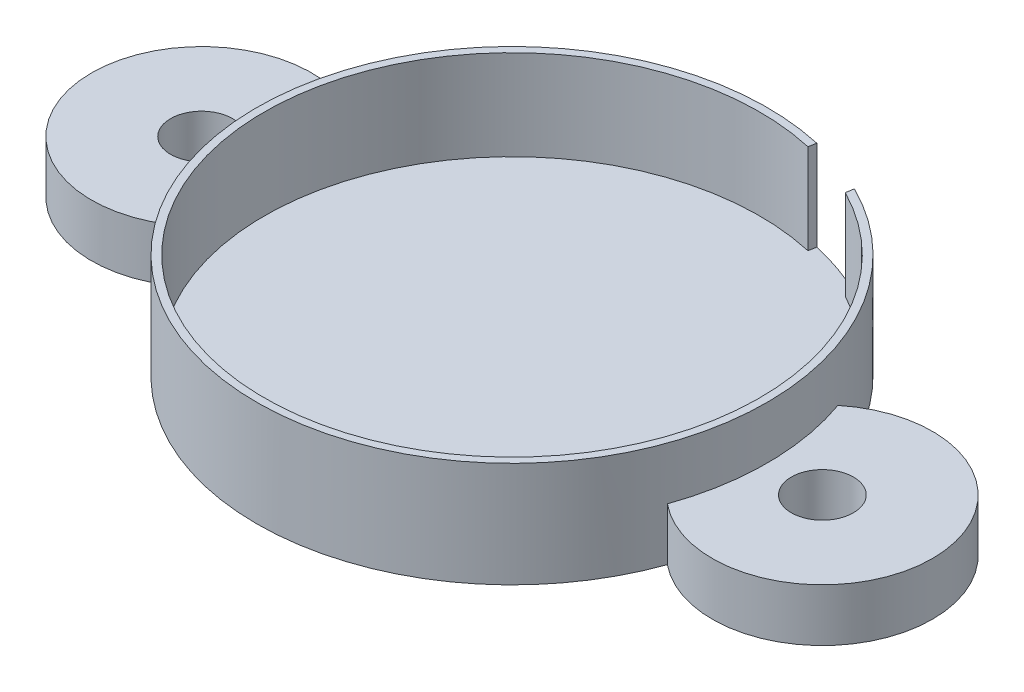
ISO-10303-21;
HEADER;
FILE_DESCRIPTION(('STEP AP214'),'2;1');
FILE_NAME('part.step','',(''),(''),'','','');
FILE_SCHEMA(('AUTOMOTIVE_DESIGN { 1 0 10303 214 1 1 1 1 }'));
ENDSEC;
DATA;
#1=APPLICATION_CONTEXT('core data for automotive mechanical design processes');
#2=APPLICATION_PROTOCOL_DEFINITION('international standard','automotive_design',2000,#1);
#3=PRODUCT_CONTEXT('',#1,'mechanical');
#4=PRODUCT('Part','Part','',(#3));
#5=PRODUCT_RELATED_PRODUCT_CATEGORY('part','',(#4));
#6=PRODUCT_DEFINITION_FORMATION('','',#4);
#7=PRODUCT_DEFINITION_CONTEXT('part definition',#1,'design');
#8=PRODUCT_DEFINITION('design','',#6,#7);
#9=PRODUCT_DEFINITION_SHAPE('','',#8);
#10=(LENGTH_UNIT() NAMED_UNIT(*) SI_UNIT(.MILLI.,.METRE.));
#11=(NAMED_UNIT(*) PLANE_ANGLE_UNIT() SI_UNIT($,.RADIAN.));
#12=(NAMED_UNIT(*) SI_UNIT($,.STERADIAN.) SOLID_ANGLE_UNIT());
#13=UNCERTAINTY_MEASURE_WITH_UNIT(LENGTH_MEASURE(1.E-05),#10,'distance_accuracy_value','');
#14=(GEOMETRIC_REPRESENTATION_CONTEXT(3) GLOBAL_UNCERTAINTY_ASSIGNED_CONTEXT((#13)) GLOBAL_UNIT_ASSIGNED_CONTEXT((#10,
#11,#12)) REPRESENTATION_CONTEXT('',''));
#15=CARTESIAN_POINT('',(0.,0.,0.));
#16=DIRECTION('',(0.,0.,1.));
#17=DIRECTION('',(1.,0.,0.));
#18=AXIS2_PLACEMENT_3D('',#15,#16,#17);
#19=CARTESIAN_POINT('',(0.,21.971,0.));
#20=DIRECTION('',(0.,-1.,0.));
#21=DIRECTION('',(0.,0.,-1.));
#22=AXIS2_PLACEMENT_3D('',#19,#20,#21);
#23=CYLINDRICAL_SURFACE('',#22,53.2765);
#24=CARTESIAN_POINT('',(0.,0.,0.));
#25=DIRECTION('',(0.,1.,0.));
#26=DIRECTION('',(0.,0.,1.));
#27=AXIS2_PLACEMENT_3D('',#24,#25,#26);
#28=CIRCLE('',#27,53.2765);
#29=CARTESIAN_POINT('',(50.2172007352941,0.,-17.7937686441399));
#30=VERTEX_POINT('',#29);
#31=CARTESIAN_POINT('',(-50.2172007352941,0.,-17.7937686441399));
#32=VERTEX_POINT('',#31);
#33=EDGE_CURVE('E39',#30,#32,#28,.T.);
#34=ORIENTED_EDGE('',*,*,#33,.T.);
#35=DIRECTION('',(0.,-1.,0.));
#36=VECTOR('',#35,1.);
#37=CARTESIAN_POINT('',(-50.2172007352941,10.9855,-17.7937686441399));
#38=LINE('',#37,#36);
#39=CARTESIAN_POINT('',(-50.2172007352941,10.9855,-17.7937686441399));
#40=VERTEX_POINT('',#39);
#41=EDGE_CURVE('E55',#40,#32,#38,.T.);
#42=ORIENTED_EDGE('',*,*,#41,.F.);
#43=CARTESIAN_POINT('',(1.04777297948999E-12,10.9855,0.));
#44=DIRECTION('',(0.,1.,0.));
#45=DIRECTION('',(0.,0.,1.));
#46=AXIS2_PLACEMENT_3D('',#43,#44,#45);
#47=CIRCLE('',#46,53.276500000001);
#48=CARTESIAN_POINT('',(-50.2172007352941,10.9855,17.7937686441399));
#49=VERTEX_POINT('',#48);
#50=EDGE_CURVE('E50',#40,#49,#47,.T.);
#51=ORIENTED_EDGE('',*,*,#50,.T.);
#52=DIRECTION('',(0.,-1.,0.));
#53=VECTOR('',#52,1.);
#54=CARTESIAN_POINT('',(-50.2172007352941,10.9855,17.7937686441399));
#55=LINE('',#54,#53);
#56=CARTESIAN_POINT('',(-50.2172007352941,0.,17.7937686441399));
#57=VERTEX_POINT('',#56);
#58=EDGE_CURVE('E108',#49,#57,#55,.T.);
#59=ORIENTED_EDGE('',*,*,#58,.T.);
#60=CARTESIAN_POINT('',(50.2172007352941,0.,17.7937686441399));
#61=VERTEX_POINT('',#60);
#62=EDGE_CURVE('E99',#57,#61,#28,.T.);
#63=ORIENTED_EDGE('',*,*,#62,.T.);
#64=DIRECTION('',(0.,-1.,0.));
#65=VECTOR('',#64,1.);
#66=CARTESIAN_POINT('',(50.2172007352941,10.9855,17.7937686441399));
#67=LINE('',#66,#65);
#68=CARTESIAN_POINT('',(50.2172007352941,10.9855,17.7937686441399));
#69=VERTEX_POINT('',#68);
#70=EDGE_CURVE('E138',#69,#61,#67,.T.);
#71=ORIENTED_EDGE('',*,*,#70,.F.);
#72=CARTESIAN_POINT('',(0.,10.9855,0.));
#73=DIRECTION('',(0.,1.,0.));
#74=DIRECTION('',(0.,0.,1.));
#75=AXIS2_PLACEMENT_3D('',#72,#73,#74);
#76=CIRCLE('',#75,53.2765);
#77=CARTESIAN_POINT('',(50.2172007352941,10.9855,-17.7937686441399));
#78=VERTEX_POINT('',#77);
#79=EDGE_CURVE('E131',#69,#78,#76,.T.);
#80=ORIENTED_EDGE('',*,*,#79,.T.);
#81=DIRECTION('',(0.,-1.,0.));
#82=VECTOR('',#81,1.);
#83=CARTESIAN_POINT('',(50.2172007352941,10.9855,-17.7937686441399));
#84=LINE('',#83,#82);
#85=EDGE_CURVE('E136',#78,#30,#84,.T.);
#86=ORIENTED_EDGE('',*,*,#85,.T.);
#87=EDGE_LOOP('',(#34,#42,#51,#59,#63,#71,#80,#86));
#88=FACE_BOUND('',#87,.T.);
#89=CARTESIAN_POINT('',(0.,3.175,0.));
#90=DIRECTION('',(0.,1.,0.));
#91=DIRECTION('',(0.,0.,1.));
#92=AXIS2_PLACEMENT_3D('',#89,#90,#91);
#93=CIRCLE('',#92,53.2765);
#94=CARTESIAN_POINT('',(23.788647288691,3.175,-47.670595889125));
#95=VERTEX_POINT('',#94);
#96=CARTESIAN_POINT('',(11.6118386253483,3.175,-51.9956792049962));
#97=VERTEX_POINT('',#96);
#98=EDGE_CURVE('E143',#95,#97,#93,.T.);
#99=ORIENTED_EDGE('',*,*,#98,.F.);
#100=DIRECTION('',(0.,1.,0.));
#101=VECTOR('',#100,1.);
#102=CARTESIAN_POINT('',(23.788647288691,3.175,-47.670595889125));
#103=LINE('',#102,#101);
#104=CARTESIAN_POINT('',(23.788647288691,21.971,-47.670595889125));
#105=VERTEX_POINT('',#104);
#106=EDGE_CURVE('E155',#95,#105,#103,.T.);
#107=ORIENTED_EDGE('',*,*,#106,.T.);
#108=CARTESIAN_POINT('',(0.,21.971,0.));
#109=DIRECTION('',(0.,1.,0.));
#110=DIRECTION('',(0.,0.,1.));
#111=AXIS2_PLACEMENT_3D('',#108,#109,#110);
#112=CIRCLE('',#111,53.2765);
#113=CARTESIAN_POINT('',(11.6118386253483,21.971,-51.9956792049962));
#114=VERTEX_POINT('',#113);
#115=EDGE_CURVE('E11',#114,#105,#112,.T.);
#116=ORIENTED_EDGE('',*,*,#115,.F.);
#117=DIRECTION('',(0.,1.,0.));
#118=VECTOR('',#117,1.);
#119=CARTESIAN_POINT('',(11.6118386253483,3.175,-51.9956792049962));
#120=LINE('',#119,#118);
#121=EDGE_CURVE('E152',#97,#114,#120,.T.);
#122=ORIENTED_EDGE('',*,*,#121,.F.);
#123=EDGE_LOOP('',(#99,#107,#116,#122));
#124=FACE_BOUND('',#123,.T.);
#125=ADVANCED_FACE('F36',(#88,#124),#23,.T.);
#126=CARTESIAN_POINT('',(0.,21.971,0.));
#127=DIRECTION('',(0.,1.,0.));
#128=DIRECTION('',(0.,0.,1.));
#129=AXIS2_PLACEMENT_3D('',#126,#127,#128);
#130=PLANE('',#129);
#131=DIRECTION('',(0.163513107643357,0.,-0.986541161649534));
#132=VECTOR('',#131,1.);
#133=CARTESIAN_POINT('',(23.5166544436369,21.971,-46.0295522982634));
#134=LINE('',#133,#132);
#135=CARTESIAN_POINT('',(23.5166544436369,21.971,-46.0295522982634));
#136=VERTEX_POINT('',#135);
#137=EDGE_CURVE('E147',#136,#105,#134,.T.);
#138=ORIENTED_EDGE('',*,*,#137,.F.);
#139=CARTESIAN_POINT('',(0.,21.971,0.));
#140=DIRECTION('',(0.,1.,0.));
#141=DIRECTION('',(0.,0.,1.));
#142=AXIS2_PLACEMENT_3D('',#139,#140,#141);
#143=CIRCLE('',#142,51.689);
#144=CARTESIAN_POINT('',(11.3334056157357,21.971,-50.4312069868371));
#145=VERTEX_POINT('',#144);
#146=EDGE_CURVE('E158',#145,#136,#143,.T.);
#147=ORIENTED_EDGE('',*,*,#146,.F.);
#148=DIRECTION('',(-0.175219154451826,0.,0.984529455076478));
#149=VECTOR('',#148,1.);
#150=CARTESIAN_POINT('',(11.3334056157357,21.971,-50.4312069868371));
#151=LINE('',#150,#149);
#152=EDGE_CURVE('E140',#114,#145,#151,.T.);
#153=ORIENTED_EDGE('',*,*,#152,.F.);
#154=ORIENTED_EDGE('',*,*,#115,.T.);
#155=EDGE_LOOP('',(#138,#147,#153,#154));
#156=FACE_BOUND('',#155,.T.);
#157=ADVANCED_FACE('F177',(#156),#130,.T.);
#158=CARTESIAN_POINT('',(0.,0.,0.));
#159=DIRECTION('',(0.,1.,0.));
#160=DIRECTION('',(0.,0.,1.));
#161=AXIS2_PLACEMENT_3D('',#158,#159,#160);
#162=PLANE('',#161);
#163=ORIENTED_EDGE('',*,*,#33,.F.);
#164=CARTESIAN_POINT('',(64.77,0.,0.));
#165=DIRECTION('',(0.,-1.,0.));
#166=DIRECTION('',(0.,0.,-1.));
#167=AXIS2_PLACEMENT_3D('',#164,#165,#166);
#168=CIRCLE('',#167,22.987);
#169=EDGE_CURVE('E105',#30,#61,#168,.T.);
#170=ORIENTED_EDGE('',*,*,#169,.T.);
#171=ORIENTED_EDGE('',*,*,#62,.F.);
#172=CARTESIAN_POINT('',(-64.77,0.,0.));
#173=DIRECTION('',(0.,-1.,0.));
#174=DIRECTION('',(0.,0.,-1.));
#175=AXIS2_PLACEMENT_3D('',#172,#173,#174);
#176=CIRCLE('',#175,22.987);
#177=EDGE_CURVE('E103',#57,#32,#176,.T.);
#178=ORIENTED_EDGE('',*,*,#177,.T.);
#179=EDGE_LOOP('',(#163,#170,#171,#178));
#180=FACE_BOUND('',#179,.T.);
#181=CARTESIAN_POINT('',(64.77,0.,0.));
#182=DIRECTION('',(0.,-1.,0.));
#183=DIRECTION('',(0.,0.,-1.));
#184=AXIS2_PLACEMENT_3D('',#181,#182,#183);
#185=CIRCLE('',#184,6.477);
#186=CARTESIAN_POINT('',(64.77,0.,-6.477));
#187=VERTEX_POINT('',#186);
#188=EDGE_CURVE('E124',#187,#187,#185,.T.);
#189=ORIENTED_EDGE('',*,*,#188,.F.);
#190=EDGE_LOOP('',(#189));
#191=FACE_BOUND('',#190,.T.);
#192=CARTESIAN_POINT('',(-64.77,0.,0.));
#193=DIRECTION('',(0.,-1.,0.));
#194=DIRECTION('',(0.,0.,-1.));
#195=AXIS2_PLACEMENT_3D('',#192,#193,#194);
#196=CIRCLE('',#195,6.477);
#197=CARTESIAN_POINT('',(-64.77,0.,-6.477));
#198=VERTEX_POINT('',#197);
#199=EDGE_CURVE('E120',#198,#198,#196,.T.);
#200=ORIENTED_EDGE('',*,*,#199,.F.);
#201=EDGE_LOOP('',(#200));
#202=FACE_BOUND('',#201,.T.);
#203=ADVANCED_FACE('F100',(#180,#191,#202),#162,.F.);
#204=CARTESIAN_POINT('',(0.,3.175,0.));
#205=DIRECTION('',(0.,1.,0.));
#206=DIRECTION('',(0.,0.,1.));
#207=AXIS2_PLACEMENT_3D('',#204,#205,#206);
#208=CYLINDRICAL_SURFACE('',#207,51.689);
#209=ORIENTED_EDGE('',*,*,#146,.T.);
#210=DIRECTION('',(0.,1.,0.));
#211=VECTOR('',#210,1.);
#212=CARTESIAN_POINT('',(23.5166544436369,3.175,-46.0295522982634));
#213=LINE('',#212,#211);
#214=CARTESIAN_POINT('',(23.5166544436369,3.175,-46.0295522982634));
#215=VERTEX_POINT('',#214);
#216=EDGE_CURVE('E159',#215,#136,#213,.T.);
#217=ORIENTED_EDGE('',*,*,#216,.F.);
#218=CARTESIAN_POINT('',(0.,3.175,0.));
#219=DIRECTION('',(0.,1.,0.));
#220=DIRECTION('',(0.,0.,1.));
#221=AXIS2_PLACEMENT_3D('',#218,#219,#220);
#222=CIRCLE('',#221,51.689);
#223=CARTESIAN_POINT('',(11.3334056157357,3.175,-50.4312069868371));
#224=VERTEX_POINT('',#223);
#225=EDGE_CURVE('E107',#224,#215,#222,.T.);
#226=ORIENTED_EDGE('',*,*,#225,.F.);
#227=DIRECTION('',(0.,1.,0.));
#228=VECTOR('',#227,1.);
#229=CARTESIAN_POINT('',(11.3334056157357,3.175,-50.4312069868371));
#230=LINE('',#229,#228);
#231=EDGE_CURVE('E161',#224,#145,#230,.T.);
#232=ORIENTED_EDGE('',*,*,#231,.T.);
#233=EDGE_LOOP('',(#209,#217,#226,#232));
#234=FACE_BOUND('',#233,.T.);
#235=ADVANCED_FACE('F171',(#234),#208,.F.);
#236=CARTESIAN_POINT('',(0.,3.175,0.));
#237=DIRECTION('',(0.,1.,0.));
#238=DIRECTION('',(0.,0.,1.));
#239=AXIS2_PLACEMENT_3D('',#236,#237,#238);
#240=PLANE('',#239);
#241=ORIENTED_EDGE('',*,*,#225,.T.);
#242=DIRECTION('',(0.163513107643357,0.,-0.986541161649534));
#243=VECTOR('',#242,1.);
#244=CARTESIAN_POINT('',(23.5166544436369,3.175,-46.0295522982634));
#245=LINE('',#244,#243);
#246=EDGE_CURVE('E149',#215,#95,#245,.T.);
#247=ORIENTED_EDGE('',*,*,#246,.T.);
#248=ORIENTED_EDGE('',*,*,#98,.T.);
#249=DIRECTION('',(-0.175219154451826,0.,0.984529455076478));
#250=VECTOR('',#249,1.);
#251=CARTESIAN_POINT('',(11.3334056157357,3.175,-50.4312069868371));
#252=LINE('',#251,#250);
#253=EDGE_CURVE('E146',#97,#224,#252,.T.);
#254=ORIENTED_EDGE('',*,*,#253,.T.);
#255=EDGE_LOOP('',(#241,#247,#248,#254));
#256=FACE_BOUND('',#255,.T.);
#257=ADVANCED_FACE('F184',(#256),#240,.T.);
#258=CARTESIAN_POINT('',(23.5166544436369,3.175,-46.0295522982634));
#259=DIRECTION('',(0.986541161649534,0.,0.163513107643357));
#260=DIRECTION('',(0.163513107643357,0.,-0.986541161649534));
#261=AXIS2_PLACEMENT_3D('',#258,#259,#260);
#262=PLANE('',#261);
#263=ORIENTED_EDGE('',*,*,#137,.T.);
#264=ORIENTED_EDGE('',*,*,#106,.F.);
#265=ORIENTED_EDGE('',*,*,#246,.F.);
#266=ORIENTED_EDGE('',*,*,#216,.T.);
#267=EDGE_LOOP('',(#263,#264,#265,#266));
#268=FACE_BOUND('',#267,.T.);
#269=ADVANCED_FACE('F180',(#268),#262,.F.);
#270=CARTESIAN_POINT('',(11.3334056157357,3.175,-50.4312069868371));
#271=DIRECTION('',(-0.984529455076478,0.,-0.175219154451826));
#272=DIRECTION('',(-0.175219154451826,0.,0.984529455076478));
#273=AXIS2_PLACEMENT_3D('',#270,#271,#272);
#274=PLANE('',#273);
#275=ORIENTED_EDGE('',*,*,#152,.T.);
#276=ORIENTED_EDGE('',*,*,#231,.F.);
#277=ORIENTED_EDGE('',*,*,#253,.F.);
#278=ORIENTED_EDGE('',*,*,#121,.T.);
#279=EDGE_LOOP('',(#275,#276,#277,#278));
#280=FACE_BOUND('',#279,.T.);
#281=ADVANCED_FACE('F186',(#280),#274,.F.);
#282=CARTESIAN_POINT('',(64.77,10.9855,0.));
#283=DIRECTION('',(0.,-1.,0.));
#284=DIRECTION('',(0.,0.,-1.));
#285=AXIS2_PLACEMENT_3D('',#282,#283,#284);
#286=CYLINDRICAL_SURFACE('',#285,22.987);
#287=ORIENTED_EDGE('',*,*,#169,.F.);
#288=ORIENTED_EDGE('',*,*,#85,.F.);
#289=CARTESIAN_POINT('',(64.77,10.9855,0.));
#290=DIRECTION('',(0.,-1.,0.));
#291=DIRECTION('',(0.,0.,-1.));
#292=AXIS2_PLACEMENT_3D('',#289,#290,#291);
#293=CIRCLE('',#292,22.987);
#294=EDGE_CURVE('E133',#78,#69,#293,.T.);
#295=ORIENTED_EDGE('',*,*,#294,.T.);
#296=ORIENTED_EDGE('',*,*,#70,.T.);
#297=EDGE_LOOP('',(#287,#288,#295,#296));
#298=FACE_BOUND('',#297,.T.);
#299=ADVANCED_FACE('F188',(#298),#286,.T.);
#300=CARTESIAN_POINT('',(32.385,10.9855,0.));
#301=DIRECTION('',(0.,1.,0.));
#302=DIRECTION('',(0.,0.,1.));
#303=AXIS2_PLACEMENT_3D('',#300,#301,#302);
#304=PLANE('',#303);
#305=CARTESIAN_POINT('',(64.77,10.9855,0.));
#306=DIRECTION('',(0.,-1.,0.));
#307=DIRECTION('',(0.,0.,-1.));
#308=AXIS2_PLACEMENT_3D('',#305,#306,#307);
#309=CIRCLE('',#308,6.477);
#310=CARTESIAN_POINT('',(64.77,10.9855,-6.477));
#311=VERTEX_POINT('',#310);
#312=EDGE_CURVE('E126',#311,#311,#309,.T.);
#313=ORIENTED_EDGE('',*,*,#312,.T.);
#314=EDGE_LOOP('',(#313));
#315=FACE_BOUND('',#314,.T.);
#316=ORIENTED_EDGE('',*,*,#79,.F.);
#317=ORIENTED_EDGE('',*,*,#294,.F.);
#318=EDGE_LOOP('',(#316,#317));
#319=FACE_BOUND('',#318,.T.);
#320=ADVANCED_FACE('F194',(#315,#319),#304,.T.);
#321=CARTESIAN_POINT('',(64.77,10.9855,0.));
#322=DIRECTION('',(0.,-1.,0.));
#323=DIRECTION('',(0.,0.,-1.));
#324=AXIS2_PLACEMENT_3D('',#321,#322,#323);
#325=CYLINDRICAL_SURFACE('',#324,6.477);
#326=ORIENTED_EDGE('',*,*,#312,.F.);
#327=EDGE_LOOP('',(#326));
#328=FACE_BOUND('',#327,.T.);
#329=ORIENTED_EDGE('',*,*,#188,.T.);
#330=EDGE_LOOP('',(#329));
#331=FACE_BOUND('',#330,.T.);
#332=ADVANCED_FACE('F250',(#328,#331),#325,.F.);
#333=CARTESIAN_POINT('',(-64.77,10.9855,0.));
#334=DIRECTION('',(0.,-1.,0.));
#335=DIRECTION('',(0.,0.,-1.));
#336=AXIS2_PLACEMENT_3D('',#333,#334,#335);
#337=CYLINDRICAL_SURFACE('',#336,22.987);
#338=ORIENTED_EDGE('',*,*,#177,.F.);
#339=ORIENTED_EDGE('',*,*,#58,.F.);
#340=CARTESIAN_POINT('',(-64.77,10.9855,0.));
#341=DIRECTION('',(0.,-1.,0.));
#342=DIRECTION('',(0.,0.,-1.));
#343=AXIS2_PLACEMENT_3D('',#340,#341,#342);
#344=CIRCLE('',#343,22.987);
#345=EDGE_CURVE('E113',#49,#40,#344,.T.);
#346=ORIENTED_EDGE('',*,*,#345,.T.);
#347=ORIENTED_EDGE('',*,*,#41,.T.);
#348=EDGE_LOOP('',(#338,#339,#346,#347));
#349=FACE_BOUND('',#348,.T.);
#350=ADVANCED_FACE('F115',(#349),#337,.T.);
#351=CARTESIAN_POINT('',(-32.3849999999995,10.9855,0.));
#352=DIRECTION('',(0.,1.,0.));
#353=DIRECTION('',(0.,0.,1.));
#354=AXIS2_PLACEMENT_3D('',#351,#352,#353);
#355=PLANE('',#354);
#356=CARTESIAN_POINT('',(-64.77,10.9855,0.));
#357=DIRECTION('',(0.,-1.,0.));
#358=DIRECTION('',(0.,0.,-1.));
#359=AXIS2_PLACEMENT_3D('',#356,#357,#358);
#360=CIRCLE('',#359,6.477);
#361=CARTESIAN_POINT('',(-64.77,10.9855,-6.477));
#362=VERTEX_POINT('',#361);
#363=EDGE_CURVE('E116',#362,#362,#360,.T.);
#364=ORIENTED_EDGE('',*,*,#363,.T.);
#365=EDGE_LOOP('',(#364));
#366=FACE_BOUND('',#365,.T.);
#367=ORIENTED_EDGE('',*,*,#50,.F.);
#368=ORIENTED_EDGE('',*,*,#345,.F.);
#369=EDGE_LOOP('',(#367,#368));
#370=FACE_BOUND('',#369,.T.);
#371=ADVANCED_FACE('F269',(#366,#370),#355,.T.);
#372=CARTESIAN_POINT('',(-64.77,10.9855,0.));
#373=DIRECTION('',(0.,-1.,0.));
#374=DIRECTION('',(0.,0.,-1.));
#375=AXIS2_PLACEMENT_3D('',#372,#373,#374);
#376=CYLINDRICAL_SURFACE('',#375,6.477);
#377=ORIENTED_EDGE('',*,*,#363,.F.);
#378=EDGE_LOOP('',(#377));
#379=FACE_BOUND('',#378,.T.);
#380=ORIENTED_EDGE('',*,*,#199,.T.);
#381=EDGE_LOOP('',(#380));
#382=FACE_BOUND('',#381,.T.);
#383=ADVANCED_FACE('F279',(#379,#382),#376,.F.);
#384=CLOSED_SHELL('',(#125,#157,#203,#235,#257,#269,#281,#299,#320,#332,#350,#371,#383));
#385=MANIFOLD_SOLID_BREP('B2',#384);
#386=ADVANCED_BREP_SHAPE_REPRESENTATION('',(#18,#385),#14);
#387=SHAPE_DEFINITION_REPRESENTATION(#9,#386);
ENDSEC;
END-ISO-10303-21;
